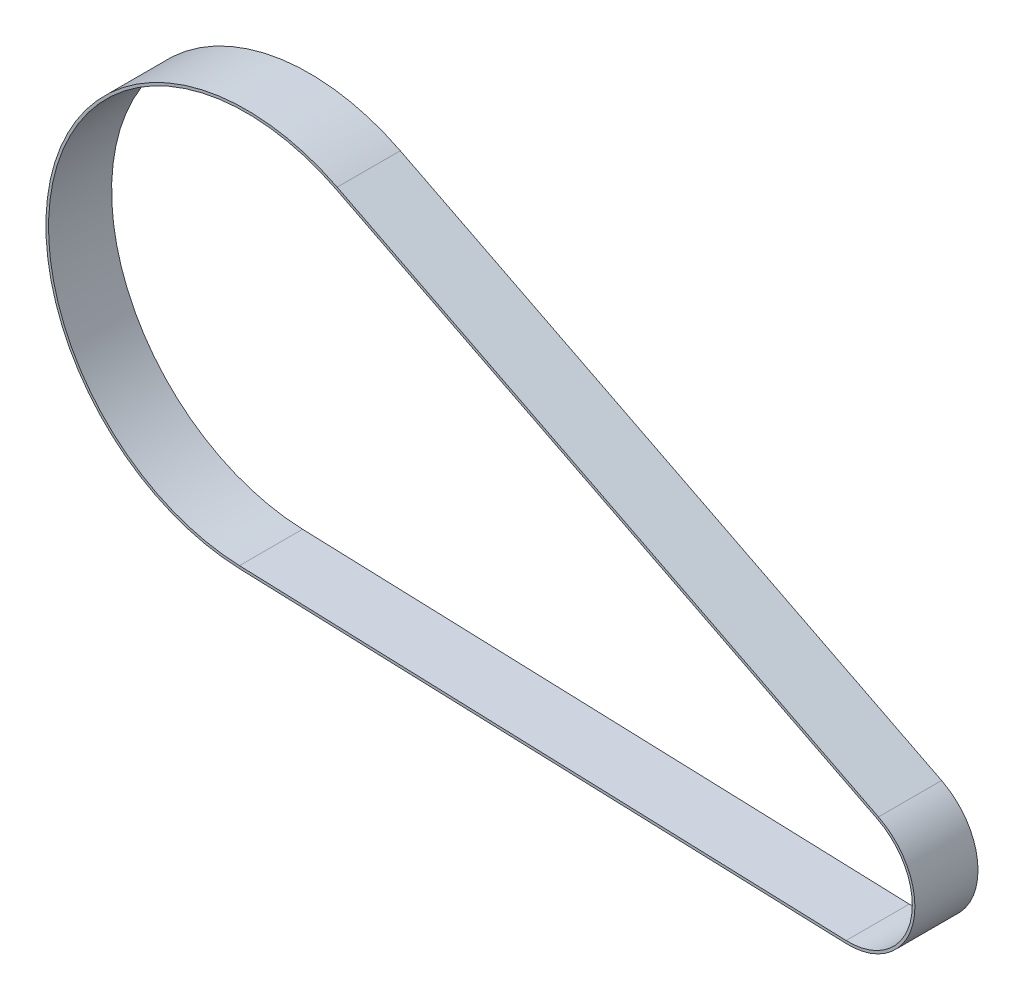
ISO-10303-21;
HEADER;
FILE_DESCRIPTION(('STEP AP214'),'2;1');
FILE_NAME('part.step','',(''),(''),'','','');
FILE_SCHEMA(('AUTOMOTIVE_DESIGN { 1 0 10303 214 1 1 1 1 }'));
ENDSEC;
DATA;
#1=APPLICATION_CONTEXT('core data for automotive mechanical design processes');
#2=APPLICATION_PROTOCOL_DEFINITION('international standard','automotive_design',2000,#1);
#3=PRODUCT_CONTEXT('',#1,'mechanical');
#4=PRODUCT('Part','Part','',(#3));
#5=PRODUCT_RELATED_PRODUCT_CATEGORY('part','',(#4));
#6=PRODUCT_DEFINITION_FORMATION('','',#4);
#7=PRODUCT_DEFINITION_CONTEXT('part definition',#1,'design');
#8=PRODUCT_DEFINITION('design','',#6,#7);
#9=PRODUCT_DEFINITION_SHAPE('','',#8);
#10=(LENGTH_UNIT() NAMED_UNIT(*) SI_UNIT(.MILLI.,.METRE.));
#11=(NAMED_UNIT(*) PLANE_ANGLE_UNIT() SI_UNIT($,.RADIAN.));
#12=(NAMED_UNIT(*) SI_UNIT($,.STERADIAN.) SOLID_ANGLE_UNIT());
#13=UNCERTAINTY_MEASURE_WITH_UNIT(LENGTH_MEASURE(1.E-05),#10,'distance_accuracy_value','');
#14=(GEOMETRIC_REPRESENTATION_CONTEXT(3) GLOBAL_UNCERTAINTY_ASSIGNED_CONTEXT((#13)) GLOBAL_UNIT_ASSIGNED_CONTEXT((#10,
#11,#12)) REPRESENTATION_CONTEXT('',''));
#15=CARTESIAN_POINT('',(0.,0.,0.));
#16=DIRECTION('',(0.,0.,1.));
#17=DIRECTION('',(1.,0.,0.));
#18=AXIS2_PLACEMENT_3D('',#15,#16,#17);
#19=CARTESIAN_POINT('',(57.2516531929619,-56.791,22.6700000000001));
#20=DIRECTION('',(0.,0.,1.));
#21=DIRECTION('',(1.,0.,0.));
#22=AXIS2_PLACEMENT_3D('',#19,#20,#21);
#23=CYLINDRICAL_SURFACE('',#22,6.32999999999999);
#24=DIRECTION('',(0.,0.,1.));
#25=VECTOR('',#24,1.);
#26=CARTESIAN_POINT('',(60.116638828705,-51.1464665997103,22.6700000000001));
#27=LINE('',#26,#25);
#28=CARTESIAN_POINT('',(60.116638828705,-51.1464665997103,22.6700000000001));
#29=VERTEX_POINT('',#28);
#30=CARTESIAN_POINT('',(60.116638828705,-51.1464665997103,28.6700000000001));
#31=VERTEX_POINT('',#30);
#32=EDGE_CURVE('E41',#29,#31,#27,.T.);
#33=ORIENTED_EDGE('',*,*,#32,.T.);
#34=CARTESIAN_POINT('',(57.2516531929619,-56.791,28.6700000000001));
#35=DIRECTION('',(0.,0.,1.));
#36=DIRECTION('',(1.,0.,0.));
#37=AXIS2_PLACEMENT_3D('',#34,#35,#36);
#38=CIRCLE('',#37,6.32999999999999);
#39=CARTESIAN_POINT('',(57.0291693056897,-63.1170889117925,28.6700000000001));
#40=VERTEX_POINT('',#39);
#41=EDGE_CURVE('E140',#40,#31,#38,.T.);
#42=ORIENTED_EDGE('',*,*,#41,.F.);
#43=DIRECTION('',(0.,0.,1.));
#44=VECTOR('',#43,1.);
#45=CARTESIAN_POINT('',(57.0291693056897,-63.1170889117925,22.6700000000001));
#46=LINE('',#45,#44);
#47=CARTESIAN_POINT('',(57.0291693056897,-63.1170889117925,22.6700000000001));
#48=VERTEX_POINT('',#47);
#49=EDGE_CURVE('E11',#48,#40,#46,.T.);
#50=ORIENTED_EDGE('',*,*,#49,.F.);
#51=CARTESIAN_POINT('',(57.2516531929619,-56.791,22.6700000000001));
#52=DIRECTION('',(0.,0.,1.));
#53=DIRECTION('',(1.,0.,0.));
#54=AXIS2_PLACEMENT_3D('',#51,#52,#53);
#55=CIRCLE('',#54,6.32999999999999);
#56=EDGE_CURVE('E168',#48,#29,#55,.T.);
#57=ORIENTED_EDGE('',*,*,#56,.T.);
#58=EDGE_LOOP('',(#33,#42,#50,#57));
#59=FACE_BOUND('',#58,.T.);
#60=ADVANCED_FACE('F38',(#59),#23,.T.);
#61=CARTESIAN_POINT('',(-0.670439202167126,-61.0878361817236,22.6700000000001));
#62=DIRECTION('',(-0.035147533534317,-0.999382134564379,0.));
#63=DIRECTION('',(0.999382134564379,-0.035147533534317,0.));
#64=AXIS2_PLACEMENT_3D('',#61,#62,#63);
#65=PLANE('',#64);
#66=ORIENTED_EDGE('',*,*,#49,.T.);
#67=DIRECTION('',(0.999382134564379,-0.035147533534317,0.));
#68=VECTOR('',#67,1.);
#69=CARTESIAN_POINT('',(-0.670439202167126,-61.0878361817236,28.6700000000001));
#70=LINE('',#69,#68);
#71=CARTESIAN_POINT('',(-0.670439202167126,-61.0878361817236,28.6700000000001));
#72=VERTEX_POINT('',#71);
#73=EDGE_CURVE('E152',#72,#40,#70,.T.);
#74=ORIENTED_EDGE('',*,*,#73,.F.);
#75=DIRECTION('',(0.,0.,1.));
#76=VECTOR('',#75,1.);
#77=CARTESIAN_POINT('',(-0.670439202167126,-61.0878361817236,22.6700000000001));
#78=LINE('',#77,#76);
#79=CARTESIAN_POINT('',(-0.670439202167126,-61.0878361817236,22.6700000000001));
#80=VERTEX_POINT('',#79);
#81=EDGE_CURVE('E47',#80,#72,#78,.T.);
#82=ORIENTED_EDGE('',*,*,#81,.F.);
#83=DIRECTION('',(0.999382134564379,-0.035147533534317,0.));
#84=VECTOR('',#83,1.);
#85=CARTESIAN_POINT('',(-0.670439202167126,-61.0878361817236,22.6700000000001));
#86=LINE('',#85,#84);
#87=EDGE_CURVE('E184',#80,#48,#86,.T.);
#88=ORIENTED_EDGE('',*,*,#87,.T.);
#89=EDGE_LOOP('',(#66,#74,#82,#88));
#90=FACE_BOUND('',#89,.T.);
#91=ADVANCED_FACE('F202',(#90),#65,.T.);
#92=CARTESIAN_POINT('',(0.,-42.0246219649081,22.6700000000001));
#93=DIRECTION('',(0.,0.,1.));
#94=DIRECTION('',(1.,0.,0.));
#95=AXIS2_PLACEMENT_3D('',#92,#93,#94);
#96=CYLINDRICAL_SURFACE('',#95,19.075);
#97=ORIENTED_EDGE('',*,*,#81,.T.);
#98=CARTESIAN_POINT('',(0.,-42.0246219649081,28.6700000000001));
#99=DIRECTION('',(0.,0.,1.));
#100=DIRECTION('',(1.,0.,0.));
#101=AXIS2_PLACEMENT_3D('',#98,#99,#100);
#102=CIRCLE('',#101,19.075);
#103=CARTESIAN_POINT('',(8.63342827832529,-25.0152262918392,28.6700000000001));
#104=VERTEX_POINT('',#103);
#105=EDGE_CURVE('E148',#104,#72,#102,.T.);
#106=ORIENTED_EDGE('',*,*,#105,.F.);
#107=DIRECTION('',(0.,0.,1.));
#108=VECTOR('',#107,1.);
#109=CARTESIAN_POINT('',(8.63342827832529,-25.0152262918392,22.6700000000001));
#110=LINE('',#109,#108);
#111=CARTESIAN_POINT('',(8.63342827832529,-25.0152262918392,22.6700000000001));
#112=VERTEX_POINT('',#111);
#113=EDGE_CURVE('E189',#112,#104,#110,.T.);
#114=ORIENTED_EDGE('',*,*,#113,.F.);
#115=CARTESIAN_POINT('',(0.,-42.0246219649081,22.6700000000001));
#116=DIRECTION('',(0.,0.,1.));
#117=DIRECTION('',(1.,0.,0.));
#118=AXIS2_PLACEMENT_3D('',#115,#116,#117);
#119=CIRCLE('',#118,19.075);
#120=EDGE_CURVE('E180',#112,#80,#119,.T.);
#121=ORIENTED_EDGE('',*,*,#120,.T.);
#122=EDGE_LOOP('',(#97,#106,#114,#121));
#123=FACE_BOUND('',#122,.T.);
#124=ADVANCED_FACE('F208',(#123),#96,.T.);
#125=CARTESIAN_POINT('',(60.116638828705,-51.1464665997103,22.6700000000001));
#126=DIRECTION('',(0.452604365836189,0.8917114376445,0.));
#127=DIRECTION('',(-0.8917114376445,0.452604365836189,0.));
#128=AXIS2_PLACEMENT_3D('',#125,#126,#127);
#129=PLANE('',#128);
#130=ORIENTED_EDGE('',*,*,#113,.T.);
#131=DIRECTION('',(-0.8917114376445,0.452604365836189,0.));
#132=VECTOR('',#131,1.);
#133=CARTESIAN_POINT('',(60.116638828705,-51.1464665997103,28.6700000000001));
#134=LINE('',#133,#132);
#135=EDGE_CURVE('E144',#31,#104,#134,.T.);
#136=ORIENTED_EDGE('',*,*,#135,.F.);
#137=ORIENTED_EDGE('',*,*,#32,.F.);
#138=DIRECTION('',(-0.8917114376445,0.452604365836189,0.));
#139=VECTOR('',#138,1.);
#140=CARTESIAN_POINT('',(60.116638828705,-51.1464665997103,22.6700000000001));
#141=LINE('',#140,#139);
#142=EDGE_CURVE('E176',#29,#112,#141,.T.);
#143=ORIENTED_EDGE('',*,*,#142,.T.);
#144=EDGE_LOOP('',(#130,#136,#137,#143));
#145=FACE_BOUND('',#144,.T.);
#146=ADVANCED_FACE('F197',(#145),#129,.T.);
#147=CARTESIAN_POINT('',(57.2516531929619,-56.791,22.6700000000001));
#148=DIRECTION('',(0.,0.,1.));
#149=DIRECTION('',(1.,0.,0.));
#150=AXIS2_PLACEMENT_3D('',#147,#148,#149);
#151=PLANE('',#150);
#152=DIRECTION('',(-0.8917114376445,0.452604365836189,0.));
#153=VECTOR('',#152,1.);
#154=CARTESIAN_POINT('',(60.003487737246,-51.3693944591215,22.6700000000001));
#155=LINE('',#154,#153);
#156=CARTESIAN_POINT('',(60.003487737246,-51.3693944591215,22.6700000000001));
#157=VERTEX_POINT('',#156);
#158=CARTESIAN_POINT('',(8.52027718686624,-25.2381541512504,22.6700000000001));
#159=VERTEX_POINT('',#158);
#160=EDGE_CURVE('E117',#157,#159,#155,.T.);
#161=ORIENTED_EDGE('',*,*,#160,.T.);
#162=CARTESIAN_POINT('',(0.,-42.0246219649081,22.6700000000001));
#163=DIRECTION('',(0.,0.,1.));
#164=DIRECTION('',(1.,0.,0.));
#165=AXIS2_PLACEMENT_3D('',#162,#163,#164);
#166=CIRCLE('',#165,18.825);
#167=CARTESIAN_POINT('',(-0.661652318783544,-60.8379906480825,22.6700000000001));
#168=VERTEX_POINT('',#167);
#169=EDGE_CURVE('E156',#159,#168,#166,.T.);
#170=ORIENTED_EDGE('',*,*,#169,.T.);
#171=DIRECTION('',(0.999382134564379,-0.0351475335343171,0.));
#172=VECTOR('',#171,1.);
#173=CARTESIAN_POINT('',(-0.661652318783544,-60.8379906480825,22.6700000000001));
#174=LINE('',#173,#172);
#175=CARTESIAN_POINT('',(57.0379561890733,-62.8672433781514,22.6700000000001));
#176=VERTEX_POINT('',#175);
#177=EDGE_CURVE('E111',#168,#176,#174,.T.);
#178=ORIENTED_EDGE('',*,*,#177,.T.);
#179=CARTESIAN_POINT('',(57.2516531929619,-56.791,22.6700000000001));
#180=DIRECTION('',(0.,0.,1.));
#181=DIRECTION('',(1.,0.,0.));
#182=AXIS2_PLACEMENT_3D('',#179,#180,#181);
#183=CIRCLE('',#182,6.08);
#184=EDGE_CURVE('E55',#176,#157,#183,.T.);
#185=ORIENTED_EDGE('',*,*,#184,.T.);
#186=EDGE_LOOP('',(#161,#170,#178,#185));
#187=FACE_BOUND('',#186,.T.);
#188=ORIENTED_EDGE('',*,*,#56,.F.);
#189=ORIENTED_EDGE('',*,*,#87,.F.);
#190=ORIENTED_EDGE('',*,*,#120,.F.);
#191=ORIENTED_EDGE('',*,*,#142,.F.);
#192=EDGE_LOOP('',(#188,#189,#190,#191));
#193=FACE_BOUND('',#192,.T.);
#194=ADVANCED_FACE('F206',(#187,#193),#151,.F.);
#195=CARTESIAN_POINT('',(0.,-42.0246219649081,22.6700000000001));
#196=DIRECTION('',(0.,0.,1.));
#197=DIRECTION('',(1.,0.,0.));
#198=AXIS2_PLACEMENT_3D('',#195,#196,#197);
#199=CYLINDRICAL_SURFACE('',#198,18.825);
#200=DIRECTION('',(0.,0.,1.));
#201=VECTOR('',#200,1.);
#202=CARTESIAN_POINT('',(8.52027718686624,-25.2381541512504,22.6700000000001));
#203=LINE('',#202,#201);
#204=CARTESIAN_POINT('',(8.52027718686624,-25.2381541512504,28.6700000000001));
#205=VERTEX_POINT('',#204);
#206=EDGE_CURVE('E122',#159,#205,#203,.T.);
#207=ORIENTED_EDGE('',*,*,#206,.T.);
#208=CARTESIAN_POINT('',(0.,-42.0246219649081,28.6700000000001));
#209=DIRECTION('',(0.,0.,1.));
#210=DIRECTION('',(1.,0.,0.));
#211=AXIS2_PLACEMENT_3D('',#208,#209,#210);
#212=CIRCLE('',#211,18.825);
#213=CARTESIAN_POINT('',(-0.661652318783544,-60.8379906480825,28.6700000000001));
#214=VERTEX_POINT('',#213);
#215=EDGE_CURVE('E120',#205,#214,#212,.T.);
#216=ORIENTED_EDGE('',*,*,#215,.T.);
#217=DIRECTION('',(0.,0.,1.));
#218=VECTOR('',#217,1.);
#219=CARTESIAN_POINT('',(-0.661652318783544,-60.8379906480825,22.6700000000001));
#220=LINE('',#219,#218);
#221=EDGE_CURVE('E104',#168,#214,#220,.T.);
#222=ORIENTED_EDGE('',*,*,#221,.F.);
#223=ORIENTED_EDGE('',*,*,#169,.F.);
#224=EDGE_LOOP('',(#207,#216,#222,#223));
#225=FACE_BOUND('',#224,.T.);
#226=ADVANCED_FACE('F121',(#225),#199,.F.);
#227=CARTESIAN_POINT('',(60.003487737246,-51.3693944591215,22.6700000000001));
#228=DIRECTION('',(0.452604365836189,0.8917114376445,0.));
#229=DIRECTION('',(-0.8917114376445,0.452604365836189,0.));
#230=AXIS2_PLACEMENT_3D('',#227,#228,#229);
#231=PLANE('',#230);
#232=DIRECTION('',(0.,0.,1.));
#233=VECTOR('',#232,1.);
#234=CARTESIAN_POINT('',(60.003487737246,-51.3693944591215,22.6700000000001));
#235=LINE('',#234,#233);
#236=CARTESIAN_POINT('',(60.003487737246,-51.3693944591215,28.6700000000001));
#237=VERTEX_POINT('',#236);
#238=EDGE_CURVE('E169',#157,#237,#235,.T.);
#239=ORIENTED_EDGE('',*,*,#238,.T.);
#240=DIRECTION('',(-0.8917114376445,0.452604365836189,0.));
#241=VECTOR('',#240,1.);
#242=CARTESIAN_POINT('',(60.003487737246,-51.3693944591215,28.6700000000001));
#243=LINE('',#242,#241);
#244=EDGE_CURVE('E135',#237,#205,#243,.T.);
#245=ORIENTED_EDGE('',*,*,#244,.T.);
#246=ORIENTED_EDGE('',*,*,#206,.F.);
#247=ORIENTED_EDGE('',*,*,#160,.F.);
#248=EDGE_LOOP('',(#239,#245,#246,#247));
#249=FACE_BOUND('',#248,.T.);
#250=ADVANCED_FACE('F251',(#249),#231,.F.);
#251=CARTESIAN_POINT('',(57.2516531929619,-56.791,22.6700000000001));
#252=DIRECTION('',(0.,0.,1.));
#253=DIRECTION('',(1.,0.,0.));
#254=AXIS2_PLACEMENT_3D('',#251,#252,#253);
#255=CYLINDRICAL_SURFACE('',#254,6.08);
#256=DIRECTION('',(0.,0.,1.));
#257=VECTOR('',#256,1.);
#258=CARTESIAN_POINT('',(57.0379561890733,-62.8672433781514,22.6700000000001));
#259=LINE('',#258,#257);
#260=CARTESIAN_POINT('',(57.0379561890733,-62.8672433781514,28.6700000000001));
#261=VERTEX_POINT('',#260);
#262=EDGE_CURVE('E116',#176,#261,#259,.T.);
#263=ORIENTED_EDGE('',*,*,#262,.T.);
#264=CARTESIAN_POINT('',(57.2516531929619,-56.791,28.6700000000001));
#265=DIRECTION('',(0.,0.,1.));
#266=DIRECTION('',(1.,0.,0.));
#267=AXIS2_PLACEMENT_3D('',#264,#265,#266);
#268=CIRCLE('',#267,6.08);
#269=EDGE_CURVE('E130',#261,#237,#268,.T.);
#270=ORIENTED_EDGE('',*,*,#269,.T.);
#271=ORIENTED_EDGE('',*,*,#238,.F.);
#272=ORIENTED_EDGE('',*,*,#184,.F.);
#273=EDGE_LOOP('',(#263,#270,#271,#272));
#274=FACE_BOUND('',#273,.T.);
#275=ADVANCED_FACE('F260',(#274),#255,.F.);
#276=CARTESIAN_POINT('',(-0.661652318783544,-60.8379906480825,22.6700000000001));
#277=DIRECTION('',(-0.0351475335343171,-0.999382134564379,0.));
#278=DIRECTION('',(0.999382134564379,-0.0351475335343171,0.));
#279=AXIS2_PLACEMENT_3D('',#276,#277,#278);
#280=PLANE('',#279);
#281=ORIENTED_EDGE('',*,*,#221,.T.);
#282=DIRECTION('',(0.999382134564379,-0.0351475335343171,0.));
#283=VECTOR('',#282,1.);
#284=CARTESIAN_POINT('',(-0.661652318783544,-60.8379906480825,28.6700000000001));
#285=LINE('',#284,#283);
#286=EDGE_CURVE('E108',#214,#261,#285,.T.);
#287=ORIENTED_EDGE('',*,*,#286,.T.);
#288=ORIENTED_EDGE('',*,*,#262,.F.);
#289=ORIENTED_EDGE('',*,*,#177,.F.);
#290=EDGE_LOOP('',(#281,#287,#288,#289));
#291=FACE_BOUND('',#290,.T.);
#292=ADVANCED_FACE('F106',(#291),#280,.F.);
#293=CARTESIAN_POINT('',(57.2516531929619,-56.791,28.6700000000001));
#294=DIRECTION('',(0.,0.,1.));
#295=DIRECTION('',(1.,0.,0.));
#296=AXIS2_PLACEMENT_3D('',#293,#294,#295);
#297=PLANE('',#296);
#298=ORIENTED_EDGE('',*,*,#41,.T.);
#299=ORIENTED_EDGE('',*,*,#135,.T.);
#300=ORIENTED_EDGE('',*,*,#105,.T.);
#301=ORIENTED_EDGE('',*,*,#73,.T.);
#302=EDGE_LOOP('',(#298,#299,#300,#301));
#303=FACE_BOUND('',#302,.T.);
#304=ORIENTED_EDGE('',*,*,#286,.F.);
#305=ORIENTED_EDGE('',*,*,#215,.F.);
#306=ORIENTED_EDGE('',*,*,#244,.F.);
#307=ORIENTED_EDGE('',*,*,#269,.F.);
#308=EDGE_LOOP('',(#304,#305,#306,#307));
#309=FACE_BOUND('',#308,.T.);
#310=ADVANCED_FACE('F128',(#303,#309),#297,.T.);
#311=CLOSED_SHELL('',(#60,#91,#124,#146,#194,#226,#250,#275,#292,#310));
#312=MANIFOLD_SOLID_BREP('B2',#311);
#313=ADVANCED_BREP_SHAPE_REPRESENTATION('',(#18,#312),#14);
#314=SHAPE_DEFINITION_REPRESENTATION(#9,#313);
ENDSEC;
END-ISO-10303-21;
